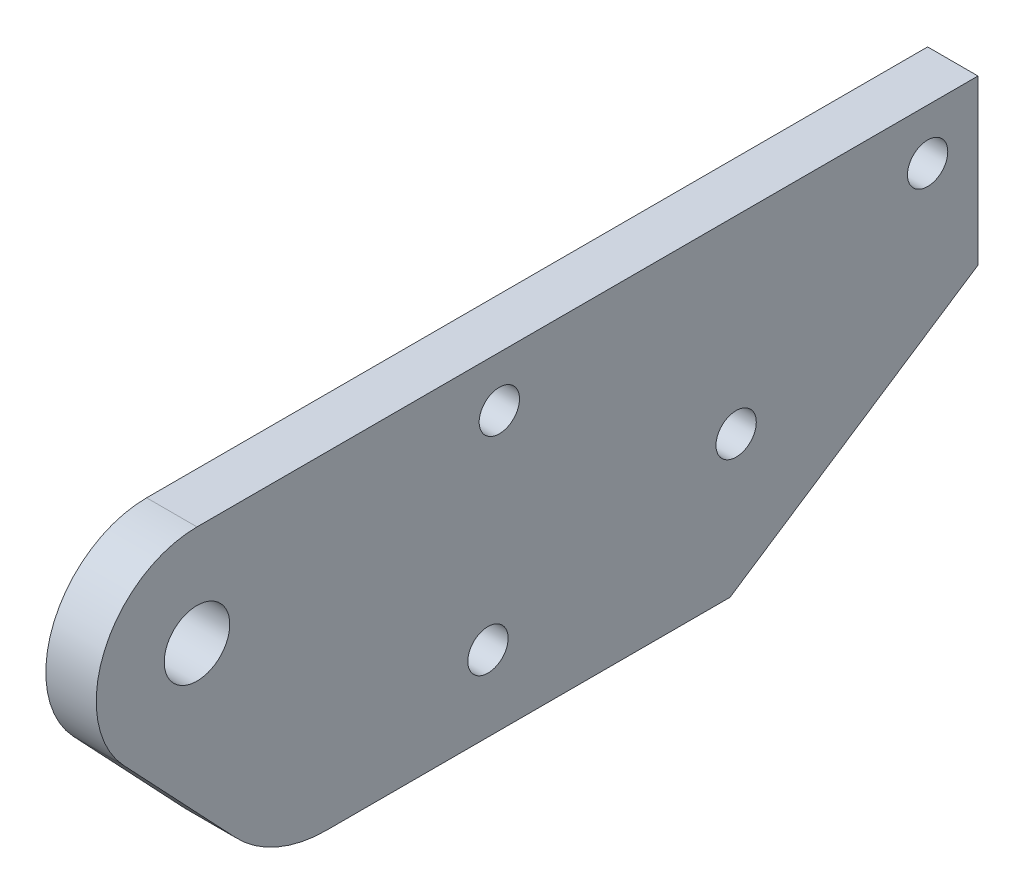
ISO-10303-21;
HEADER;
FILE_DESCRIPTION(('STEP AP214'),'2;1');
FILE_NAME('part.step','',(''),(''),'','','');
FILE_SCHEMA(('AUTOMOTIVE_DESIGN { 1 0 10303 214 1 1 1 1 }'));
ENDSEC;
DATA;
#1=APPLICATION_CONTEXT('core data for automotive mechanical design processes');
#2=APPLICATION_PROTOCOL_DEFINITION('international standard','automotive_design',2000,#1);
#3=PRODUCT_CONTEXT('',#1,'mechanical');
#4=PRODUCT('Part','Part','',(#3));
#5=PRODUCT_RELATED_PRODUCT_CATEGORY('part','',(#4));
#6=PRODUCT_DEFINITION_FORMATION('','',#4);
#7=PRODUCT_DEFINITION_CONTEXT('part definition',#1,'design');
#8=PRODUCT_DEFINITION('design','',#6,#7);
#9=PRODUCT_DEFINITION_SHAPE('','',#8);
#10=(LENGTH_UNIT() NAMED_UNIT(*) SI_UNIT(.MILLI.,.METRE.));
#11=(NAMED_UNIT(*) PLANE_ANGLE_UNIT() SI_UNIT($,.RADIAN.));
#12=(NAMED_UNIT(*) SI_UNIT($,.STERADIAN.) SOLID_ANGLE_UNIT());
#13=UNCERTAINTY_MEASURE_WITH_UNIT(LENGTH_MEASURE(1.E-05),#10,'distance_accuracy_value','');
#14=(GEOMETRIC_REPRESENTATION_CONTEXT(3) GLOBAL_UNCERTAINTY_ASSIGNED_CONTEXT((#13)) GLOBAL_UNIT_ASSIGNED_CONTEXT((#10,
#11,#12)) REPRESENTATION_CONTEXT('',''));
#15=CARTESIAN_POINT('',(0.,0.,0.));
#16=DIRECTION('',(0.,0.,1.));
#17=DIRECTION('',(1.,0.,0.));
#18=AXIS2_PLACEMENT_3D('',#15,#16,#17);
#19=CARTESIAN_POINT('',(4.,11.8788400532718,23.8951169729925));
#20=DIRECTION('',(-1.,0.,0.));
#21=DIRECTION('',(0.,0.,1.));
#22=AXIS2_PLACEMENT_3D('',#19,#20,#21);
#23=PLANE('',#22);
#24=DIRECTION('',(0.,1.,0.));
#25=VECTOR('',#24,1.);
#26=CARTESIAN_POINT('',(4.,27.8788400532719,-27.7954020523593));
#27=LINE('',#26,#25);
#28=CARTESIAN_POINT('',(4.,14.8788400532719,-27.7954020523593));
#29=VERTEX_POINT('',#28);
#30=CARTESIAN_POINT('',(4.,27.8788400532719,-27.7954020523593));
#31=VERTEX_POINT('',#30);
#32=EDGE_CURVE('E138',#29,#31,#27,.T.);
#33=ORIENTED_EDGE('',*,*,#32,.T.);
#34=DIRECTION('',(0.,0.,1.));
#35=VECTOR('',#34,1.);
#36=CARTESIAN_POINT('',(4.,27.8788400532719,-27.7954020523593));
#37=LINE('',#36,#35);
#38=CARTESIAN_POINT('',(4.,27.8788400532719,34.2045979476407));
#39=VERTEX_POINT('',#38);
#40=EDGE_CURVE('E91',#31,#39,#37,.T.);
#41=ORIENTED_EDGE('',*,*,#40,.T.);
#42=CARTESIAN_POINT('',(4.,19.8788400532719,34.2045979476404));
#43=DIRECTION('',(1.,0.,0.));
#44=DIRECTION('',(0.,0.,-1.));
#45=AXIS2_PLACEMENT_3D('',#42,#43,#44);
#46=CIRCLE('',#45,8.00000000000008);
#47=CARTESIAN_POINT('',(4.,14.3848866487272,40.019791494608));
#48=VERTEX_POINT('',#47);
#49=EDGE_CURVE('E150',#39,#48,#46,.T.);
#50=ORIENTED_EDGE('',*,*,#49,.T.);
#51=DIRECTION('',(0.,-0.726899193370933,-0.686744175568084));
#52=VECTOR('',#51,1.);
#53=CARTESIAN_POINT('',(4.,5.01139829759096,31.1641089067018));
#54=LINE('',#53,#52);
#55=CARTESIAN_POINT('',(4.,5.01139829759096,31.1641089067018));
#56=VERTEX_POINT('',#55);
#57=EDGE_CURVE('E107',#48,#56,#54,.T.);
#58=ORIENTED_EDGE('',*,*,#57,.T.);
#59=CARTESIAN_POINT('',(4.,11.8788400532718,23.8951169729925));
#60=DIRECTION('',(1.,0.,0.));
#61=DIRECTION('',(0.,0.,1.));
#62=AXIS2_PLACEMENT_3D('',#59,#60,#61);
#63=CIRCLE('',#62,10.);
#64=CARTESIAN_POINT('',(4.,1.8788400532718,23.8951169729925));
#65=VERTEX_POINT('',#64);
#66=EDGE_CURVE('E101',#56,#65,#63,.T.);
#67=ORIENTED_EDGE('',*,*,#66,.T.);
#68=DIRECTION('',(0.,0.,-1.));
#69=VECTOR('',#68,1.);
#70=CARTESIAN_POINT('',(4.,1.8788400532718,-8.10488302700753));
#71=LINE('',#70,#69);
#72=CARTESIAN_POINT('',(4.,1.8788400532718,-8.10488302700753));
#73=VERTEX_POINT('',#72);
#74=EDGE_CURVE('E105',#65,#73,#71,.T.);
#75=ORIENTED_EDGE('',*,*,#74,.T.);
#76=DIRECTION('',(0.,0.55096789139895,-0.834526442149915));
#77=VECTOR('',#76,1.);
#78=CARTESIAN_POINT('',(4.,1.8788400532718,-8.10488302700753));
#79=LINE('',#78,#77);
#80=EDGE_CURVE('E51',#73,#29,#79,.T.);
#81=ORIENTED_EDGE('',*,*,#80,.T.);
#82=EDGE_LOOP('',(#33,#41,#50,#58,#67,#75,#81));
#83=FACE_BOUND('',#82,.T.);
#84=CARTESIAN_POINT('',(4.,23.8788400532719,-23.7954020523593));
#85=DIRECTION('',(1.,0.,0.));
#86=DIRECTION('',(0.,0.,-1.));
#87=AXIS2_PLACEMENT_3D('',#84,#85,#86);
#88=CIRCLE('',#87,1.6);
#89=CARTESIAN_POINT('',(4.,23.8788400532719,-25.3954020523593));
#90=VERTEX_POINT('',#89);
#91=EDGE_CURVE('E129',#90,#90,#88,.T.);
#92=ORIENTED_EDGE('',*,*,#91,.F.);
#93=EDGE_LOOP('',(#92));
#94=FACE_BOUND('',#93,.T.);
#95=CARTESIAN_POINT('',(4.,23.8788400532719,10.2045979476407));
#96=DIRECTION('',(1.,0.,0.));
#97=DIRECTION('',(0.,0.,-1.));
#98=AXIS2_PLACEMENT_3D('',#95,#96,#97);
#99=CIRCLE('',#98,1.6);
#100=CARTESIAN_POINT('',(4.,23.8788400532719,8.60459794764069));
#101=VERTEX_POINT('',#100);
#102=EDGE_CURVE('E165',#101,#101,#99,.T.);
#103=ORIENTED_EDGE('',*,*,#102,.F.);
#104=EDGE_LOOP('',(#103));
#105=FACE_BOUND('',#104,.T.);
#106=CARTESIAN_POINT('',(4.,12.8788400532718,-8.59540205235942));
#107=DIRECTION('',(1.,0.,0.));
#108=DIRECTION('',(0.,0.,-1.));
#109=AXIS2_PLACEMENT_3D('',#106,#107,#108);
#110=CIRCLE('',#109,1.6);
#111=CARTESIAN_POINT('',(4.,12.8788400532718,-10.1954020523594));
#112=VERTEX_POINT('',#111);
#113=EDGE_CURVE('E171',#112,#112,#110,.T.);
#114=ORIENTED_EDGE('',*,*,#113,.F.);
#115=EDGE_LOOP('',(#114));
#116=FACE_BOUND('',#115,.T.);
#117=CARTESIAN_POINT('',(4.,7.87884005327179,11.1045979476406));
#118=DIRECTION('',(1.,0.,0.));
#119=DIRECTION('',(0.,0.,-1.));
#120=AXIS2_PLACEMENT_3D('',#117,#118,#119);
#121=CIRCLE('',#120,1.6);
#122=CARTESIAN_POINT('',(4.,7.87884005327179,9.50459794764057));
#123=VERTEX_POINT('',#122);
#124=EDGE_CURVE('E177',#123,#123,#121,.T.);
#125=ORIENTED_EDGE('',*,*,#124,.F.);
#126=EDGE_LOOP('',(#125));
#127=FACE_BOUND('',#126,.T.);
#128=CARTESIAN_POINT('',(4.,19.8788400532719,34.2045979476404));
#129=DIRECTION('',(1.,0.,0.));
#130=DIRECTION('',(0.,0.,-1.));
#131=AXIS2_PLACEMENT_3D('',#128,#129,#130);
#132=CIRCLE('',#131,2.6);
#133=CARTESIAN_POINT('',(4.,19.8788400532719,31.6045979476404));
#134=VERTEX_POINT('',#133);
#135=EDGE_CURVE('E183',#134,#134,#132,.T.);
#136=ORIENTED_EDGE('',*,*,#135,.F.);
#137=EDGE_LOOP('',(#136));
#138=FACE_BOUND('',#137,.T.);
#139=ADVANCED_FACE('F34',(#83,#94,#105,#116,#127,#138),#23,.F.);
#140=CARTESIAN_POINT('',(0.,11.8788400532718,23.8951169729925));
#141=DIRECTION('',(-1.,0.,0.));
#142=DIRECTION('',(0.,0.,1.));
#143=AXIS2_PLACEMENT_3D('',#140,#141,#142);
#144=PLANE('',#143);
#145=CARTESIAN_POINT('',(0.,7.87884005327179,11.1045979476406));
#146=DIRECTION('',(1.,0.,0.));
#147=DIRECTION('',(0.,0.,-1.));
#148=AXIS2_PLACEMENT_3D('',#145,#146,#147);
#149=CIRCLE('',#148,1.6);
#150=CARTESIAN_POINT('',(0.,7.87884005327179,9.50459794764057));
#151=VERTEX_POINT('',#150);
#152=EDGE_CURVE('E180',#151,#151,#149,.T.);
#153=ORIENTED_EDGE('',*,*,#152,.T.);
#154=EDGE_LOOP('',(#153));
#155=FACE_BOUND('',#154,.T.);
#156=CARTESIAN_POINT('',(0.,23.8788400532719,10.2045979476407));
#157=DIRECTION('',(1.,0.,0.));
#158=DIRECTION('',(0.,0.,-1.));
#159=AXIS2_PLACEMENT_3D('',#156,#157,#158);
#160=CIRCLE('',#159,1.6);
#161=CARTESIAN_POINT('',(0.,23.8788400532719,8.60459794764069));
#162=VERTEX_POINT('',#161);
#163=EDGE_CURVE('E168',#162,#162,#160,.T.);
#164=ORIENTED_EDGE('',*,*,#163,.T.);
#165=EDGE_LOOP('',(#164));
#166=FACE_BOUND('',#165,.T.);
#167=DIRECTION('',(0.,1.,0.));
#168=VECTOR('',#167,1.);
#169=CARTESIAN_POINT('',(0.,27.8788400532719,-27.7954020523593));
#170=LINE('',#169,#168);
#171=CARTESIAN_POINT('',(0.,14.8788400532719,-27.7954020523593));
#172=VERTEX_POINT('',#171);
#173=CARTESIAN_POINT('',(0.,27.8788400532719,-27.7954020523593));
#174=VERTEX_POINT('',#173);
#175=EDGE_CURVE('E125',#172,#174,#170,.T.);
#176=ORIENTED_EDGE('',*,*,#175,.F.);
#177=DIRECTION('',(0.,0.55096789139895,-0.834526442149915));
#178=VECTOR('',#177,1.);
#179=CARTESIAN_POINT('',(0.,1.8788400532718,-8.10488302700753));
#180=LINE('',#179,#178);
#181=CARTESIAN_POINT('',(0.,1.8788400532718,-8.10488302700753));
#182=VERTEX_POINT('',#181);
#183=EDGE_CURVE('E83',#182,#172,#180,.T.);
#184=ORIENTED_EDGE('',*,*,#183,.F.);
#185=DIRECTION('',(0.,0.,-1.));
#186=VECTOR('',#185,1.);
#187=CARTESIAN_POINT('',(0.,1.8788400532718,-8.10488302700753));
#188=LINE('',#187,#186);
#189=CARTESIAN_POINT('',(0.,1.8788400532718,23.8951169729925));
#190=VERTEX_POINT('',#189);
#191=EDGE_CURVE('E77',#190,#182,#188,.T.);
#192=ORIENTED_EDGE('',*,*,#191,.F.);
#193=CARTESIAN_POINT('',(0.,11.8788400532718,23.8951169729925));
#194=DIRECTION('',(1.,0.,0.));
#195=DIRECTION('',(0.,0.,1.));
#196=AXIS2_PLACEMENT_3D('',#193,#194,#195);
#197=CIRCLE('',#196,10.);
#198=CARTESIAN_POINT('',(0.,5.01139829759096,31.1641089067018));
#199=VERTEX_POINT('',#198);
#200=EDGE_CURVE('E115',#199,#190,#197,.T.);
#201=ORIENTED_EDGE('',*,*,#200,.F.);
#202=DIRECTION('',(0.,-0.726899193370933,-0.686744175568084));
#203=VECTOR('',#202,1.);
#204=CARTESIAN_POINT('',(0.,5.01139829759096,31.1641089067018));
#205=LINE('',#204,#203);
#206=CARTESIAN_POINT('',(0.,14.3848866487272,40.019791494608));
#207=VERTEX_POINT('',#206);
#208=EDGE_CURVE('E133',#207,#199,#205,.T.);
#209=ORIENTED_EDGE('',*,*,#208,.F.);
#210=CARTESIAN_POINT('',(0.,19.8788400532719,34.2045979476404));
#211=DIRECTION('',(1.,0.,0.));
#212=DIRECTION('',(0.,0.,-1.));
#213=AXIS2_PLACEMENT_3D('',#210,#211,#212);
#214=CIRCLE('',#213,8.00000000000008);
#215=CARTESIAN_POINT('',(0.,27.8788400532719,34.2045979476407));
#216=VERTEX_POINT('',#215);
#217=EDGE_CURVE('E131',#216,#207,#214,.T.);
#218=ORIENTED_EDGE('',*,*,#217,.F.);
#219=DIRECTION('',(0.,0.,1.));
#220=VECTOR('',#219,1.);
#221=CARTESIAN_POINT('',(0.,27.8788400532719,-27.7954020523593));
#222=LINE('',#221,#220);
#223=EDGE_CURVE('E128',#174,#216,#222,.T.);
#224=ORIENTED_EDGE('',*,*,#223,.F.);
#225=EDGE_LOOP('',(#176,#184,#192,#201,#209,#218,#224));
#226=FACE_BOUND('',#225,.T.);
#227=CARTESIAN_POINT('',(0.,23.8788400532719,-23.7954020523593));
#228=DIRECTION('',(1.,0.,0.));
#229=DIRECTION('',(0.,0.,-1.));
#230=AXIS2_PLACEMENT_3D('',#227,#228,#229);
#231=CIRCLE('',#230,1.6);
#232=CARTESIAN_POINT('',(0.,23.8788400532719,-25.3954020523593));
#233=VERTEX_POINT('',#232);
#234=EDGE_CURVE('E162',#233,#233,#231,.T.);
#235=ORIENTED_EDGE('',*,*,#234,.T.);
#236=EDGE_LOOP('',(#235));
#237=FACE_BOUND('',#236,.T.);
#238=CARTESIAN_POINT('',(0.,12.8788400532718,-8.59540205235942));
#239=DIRECTION('',(1.,0.,0.));
#240=DIRECTION('',(0.,0.,-1.));
#241=AXIS2_PLACEMENT_3D('',#238,#239,#240);
#242=CIRCLE('',#241,1.6);
#243=CARTESIAN_POINT('',(0.,12.8788400532718,-10.1954020523594));
#244=VERTEX_POINT('',#243);
#245=EDGE_CURVE('E174',#244,#244,#242,.T.);
#246=ORIENTED_EDGE('',*,*,#245,.T.);
#247=EDGE_LOOP('',(#246));
#248=FACE_BOUND('',#247,.T.);
#249=CARTESIAN_POINT('',(0.,19.8788400532719,34.2045979476404));
#250=DIRECTION('',(1.,0.,0.));
#251=DIRECTION('',(0.,0.,-1.));
#252=AXIS2_PLACEMENT_3D('',#249,#250,#251);
#253=CIRCLE('',#252,2.6);
#254=CARTESIAN_POINT('',(0.,19.8788400532719,31.6045979476404));
#255=VERTEX_POINT('',#254);
#256=EDGE_CURVE('E186',#255,#255,#253,.T.);
#257=ORIENTED_EDGE('',*,*,#256,.T.);
#258=EDGE_LOOP('',(#257));
#259=FACE_BOUND('',#258,.T.);
#260=ADVANCED_FACE('F154',(#155,#166,#226,#237,#248,#259),#144,.T.);
#261=CARTESIAN_POINT('',(4.,27.8788400532719,-27.7954020523593));
#262=DIRECTION('',(0.,0.,1.));
#263=DIRECTION('',(1.,0.,0.));
#264=AXIS2_PLACEMENT_3D('',#261,#262,#263);
#265=PLANE('',#264);
#266=ORIENTED_EDGE('',*,*,#175,.T.);
#267=DIRECTION('',(-1.,0.,0.));
#268=VECTOR('',#267,1.);
#269=CARTESIAN_POINT('',(4.,27.8788400532719,-27.7954020523593));
#270=LINE('',#269,#268);
#271=EDGE_CURVE('E11',#31,#174,#270,.T.);
#272=ORIENTED_EDGE('',*,*,#271,.F.);
#273=ORIENTED_EDGE('',*,*,#32,.F.);
#274=DIRECTION('',(-1.,0.,0.));
#275=VECTOR('',#274,1.);
#276=CARTESIAN_POINT('',(4.,14.8788400532719,-27.7954020523593));
#277=LINE('',#276,#275);
#278=EDGE_CURVE('E121',#29,#172,#277,.T.);
#279=ORIENTED_EDGE('',*,*,#278,.T.);
#280=EDGE_LOOP('',(#266,#272,#273,#279));
#281=FACE_BOUND('',#280,.T.);
#282=ADVANCED_FACE('F36',(#281),#265,.F.);
#283=CARTESIAN_POINT('',(4.,27.8788400532719,-27.7954020523593));
#284=DIRECTION('',(0.,-1.,0.));
#285=DIRECTION('',(0.,0.,-1.));
#286=AXIS2_PLACEMENT_3D('',#283,#284,#285);
#287=PLANE('',#286);
#288=ORIENTED_EDGE('',*,*,#223,.T.);
#289=DIRECTION('',(-1.,0.,0.));
#290=VECTOR('',#289,1.);
#291=CARTESIAN_POINT('',(4.,27.8788400532719,34.2045979476407));
#292=LINE('',#291,#290);
#293=EDGE_CURVE('E43',#39,#216,#292,.T.);
#294=ORIENTED_EDGE('',*,*,#293,.F.);
#295=ORIENTED_EDGE('',*,*,#40,.F.);
#296=ORIENTED_EDGE('',*,*,#271,.T.);
#297=EDGE_LOOP('',(#288,#294,#295,#296));
#298=FACE_BOUND('',#297,.T.);
#299=ADVANCED_FACE('F216',(#298),#287,.F.);
#300=CARTESIAN_POINT('',(4.,19.8788400532719,34.2045979476404));
#301=DIRECTION('',(-1.,0.,0.));
#302=DIRECTION('',(0.,0.,1.));
#303=AXIS2_PLACEMENT_3D('',#300,#301,#302);
#304=CYLINDRICAL_SURFACE('',#303,8.00000000000008);
#305=ORIENTED_EDGE('',*,*,#217,.T.);
#306=DIRECTION('',(-1.,0.,0.));
#307=VECTOR('',#306,1.);
#308=CARTESIAN_POINT('',(4.,14.3848866487272,40.019791494608));
#309=LINE('',#308,#307);
#310=EDGE_CURVE('E142',#48,#207,#309,.T.);
#311=ORIENTED_EDGE('',*,*,#310,.F.);
#312=ORIENTED_EDGE('',*,*,#49,.F.);
#313=ORIENTED_EDGE('',*,*,#293,.T.);
#314=EDGE_LOOP('',(#305,#311,#312,#313));
#315=FACE_BOUND('',#314,.T.);
#316=ADVANCED_FACE('F148',(#315),#304,.T.);
#317=CARTESIAN_POINT('',(4.,5.01139829759096,31.1641089067018));
#318=DIRECTION('',(0.,0.686744175568084,-0.726899193370933));
#319=DIRECTION('',(0.,0.726899193370933,0.686744175568084));
#320=AXIS2_PLACEMENT_3D('',#317,#318,#319);
#321=PLANE('',#320);
#322=ORIENTED_EDGE('',*,*,#208,.T.);
#323=DIRECTION('',(-1.,0.,0.));
#324=VECTOR('',#323,1.);
#325=CARTESIAN_POINT('',(4.,5.01139829759096,31.1641089067018));
#326=LINE('',#325,#324);
#327=EDGE_CURVE('E116',#56,#199,#326,.T.);
#328=ORIENTED_EDGE('',*,*,#327,.F.);
#329=ORIENTED_EDGE('',*,*,#57,.F.);
#330=ORIENTED_EDGE('',*,*,#310,.T.);
#331=EDGE_LOOP('',(#322,#328,#329,#330));
#332=FACE_BOUND('',#331,.T.);
#333=ADVANCED_FACE('F157',(#332),#321,.F.);
#334=CARTESIAN_POINT('',(4.,11.8788400532718,23.8951169729925));
#335=DIRECTION('',(-1.,0.,0.));
#336=DIRECTION('',(0.,0.,1.));
#337=AXIS2_PLACEMENT_3D('',#334,#335,#336);
#338=CYLINDRICAL_SURFACE('',#337,10.);
#339=ORIENTED_EDGE('',*,*,#200,.T.);
#340=DIRECTION('',(-1.,0.,0.));
#341=VECTOR('',#340,1.);
#342=CARTESIAN_POINT('',(4.,1.8788400532718,23.8951169729925));
#343=LINE('',#342,#341);
#344=EDGE_CURVE('E112',#65,#190,#343,.T.);
#345=ORIENTED_EDGE('',*,*,#344,.F.);
#346=ORIENTED_EDGE('',*,*,#66,.F.);
#347=ORIENTED_EDGE('',*,*,#327,.T.);
#348=EDGE_LOOP('',(#339,#345,#346,#347));
#349=FACE_BOUND('',#348,.T.);
#350=ADVANCED_FACE('F113',(#349),#338,.T.);
#351=CARTESIAN_POINT('',(4.,1.8788400532718,-8.10488302700753));
#352=DIRECTION('',(0.,1.,0.));
#353=DIRECTION('',(0.,0.,1.));
#354=AXIS2_PLACEMENT_3D('',#351,#352,#353);
#355=PLANE('',#354);
#356=ORIENTED_EDGE('',*,*,#191,.T.);
#357=DIRECTION('',(-1.,0.,0.));
#358=VECTOR('',#357,1.);
#359=CARTESIAN_POINT('',(4.,1.8788400532718,-8.10488302700753));
#360=LINE('',#359,#358);
#361=EDGE_CURVE('E117',#73,#182,#360,.T.);
#362=ORIENTED_EDGE('',*,*,#361,.F.);
#363=ORIENTED_EDGE('',*,*,#74,.F.);
#364=ORIENTED_EDGE('',*,*,#344,.T.);
#365=EDGE_LOOP('',(#356,#362,#363,#364));
#366=FACE_BOUND('',#365,.T.);
#367=ADVANCED_FACE('F119',(#366),#355,.F.);
#368=CARTESIAN_POINT('',(4.,1.8788400532718,-8.10488302700753));
#369=DIRECTION('',(0.,0.834526442149915,0.55096789139895));
#370=DIRECTION('',(0.,-0.55096789139895,0.834526442149915));
#371=AXIS2_PLACEMENT_3D('',#368,#369,#370);
#372=PLANE('',#371);
#373=ORIENTED_EDGE('',*,*,#183,.T.);
#374=ORIENTED_EDGE('',*,*,#278,.F.);
#375=ORIENTED_EDGE('',*,*,#80,.F.);
#376=ORIENTED_EDGE('',*,*,#361,.T.);
#377=EDGE_LOOP('',(#373,#374,#375,#376));
#378=FACE_BOUND('',#377,.T.);
#379=ADVANCED_FACE('F206',(#378),#372,.F.);
#380=CARTESIAN_POINT('',(4.,23.8788400532719,-23.7954020523593));
#381=DIRECTION('',(-1.,0.,0.));
#382=DIRECTION('',(0.,0.,1.));
#383=AXIS2_PLACEMENT_3D('',#380,#381,#382);
#384=CYLINDRICAL_SURFACE('',#383,1.6);
#385=ORIENTED_EDGE('',*,*,#91,.T.);
#386=EDGE_LOOP('',(#385));
#387=FACE_BOUND('',#386,.T.);
#388=ORIENTED_EDGE('',*,*,#234,.F.);
#389=EDGE_LOOP('',(#388));
#390=FACE_BOUND('',#389,.T.);
#391=ADVANCED_FACE('F203',(#387,#390),#384,.F.);
#392=CARTESIAN_POINT('',(4.,23.8788400532719,10.2045979476407));
#393=DIRECTION('',(-1.,0.,0.));
#394=DIRECTION('',(0.,0.,1.));
#395=AXIS2_PLACEMENT_3D('',#392,#393,#394);
#396=CYLINDRICAL_SURFACE('',#395,1.6);
#397=ORIENTED_EDGE('',*,*,#102,.T.);
#398=EDGE_LOOP('',(#397));
#399=FACE_BOUND('',#398,.T.);
#400=ORIENTED_EDGE('',*,*,#163,.F.);
#401=EDGE_LOOP('',(#400));
#402=FACE_BOUND('',#401,.T.);
#403=ADVANCED_FACE('F275',(#399,#402),#396,.F.);
#404=CARTESIAN_POINT('',(4.,12.8788400532718,-8.59540205235942));
#405=DIRECTION('',(-1.,0.,0.));
#406=DIRECTION('',(0.,0.,1.));
#407=AXIS2_PLACEMENT_3D('',#404,#405,#406);
#408=CYLINDRICAL_SURFACE('',#407,1.6);
#409=ORIENTED_EDGE('',*,*,#113,.T.);
#410=EDGE_LOOP('',(#409));
#411=FACE_BOUND('',#410,.T.);
#412=ORIENTED_EDGE('',*,*,#245,.F.);
#413=EDGE_LOOP('',(#412));
#414=FACE_BOUND('',#413,.T.);
#415=ADVANCED_FACE('F283',(#411,#414),#408,.F.);
#416=CARTESIAN_POINT('',(4.,7.87884005327179,11.1045979476406));
#417=DIRECTION('',(-1.,0.,0.));
#418=DIRECTION('',(0.,0.,1.));
#419=AXIS2_PLACEMENT_3D('',#416,#417,#418);
#420=CYLINDRICAL_SURFACE('',#419,1.6);
#421=ORIENTED_EDGE('',*,*,#124,.T.);
#422=EDGE_LOOP('',(#421));
#423=FACE_BOUND('',#422,.T.);
#424=ORIENTED_EDGE('',*,*,#152,.F.);
#425=EDGE_LOOP('',(#424));
#426=FACE_BOUND('',#425,.T.);
#427=ADVANCED_FACE('F291',(#423,#426),#420,.F.);
#428=CARTESIAN_POINT('',(4.,19.8788400532719,34.2045979476404));
#429=DIRECTION('',(-1.,0.,0.));
#430=DIRECTION('',(0.,0.,1.));
#431=AXIS2_PLACEMENT_3D('',#428,#429,#430);
#432=CYLINDRICAL_SURFACE('',#431,2.6);
#433=ORIENTED_EDGE('',*,*,#135,.T.);
#434=EDGE_LOOP('',(#433));
#435=FACE_BOUND('',#434,.T.);
#436=ORIENTED_EDGE('',*,*,#256,.F.);
#437=EDGE_LOOP('',(#436));
#438=FACE_BOUND('',#437,.T.);
#439=ADVANCED_FACE('F192',(#435,#438),#432,.F.);
#440=CLOSED_SHELL('',(#139,#260,#282,#299,#316,#333,#350,#367,#379,#391,#403,#415,#427,#439));
#441=MANIFOLD_SOLID_BREP('B2',#440);
#442=ADVANCED_BREP_SHAPE_REPRESENTATION('',(#18,#441),#14);
#443=SHAPE_DEFINITION_REPRESENTATION(#9,#442);
ENDSEC;
END-ISO-10303-21;
